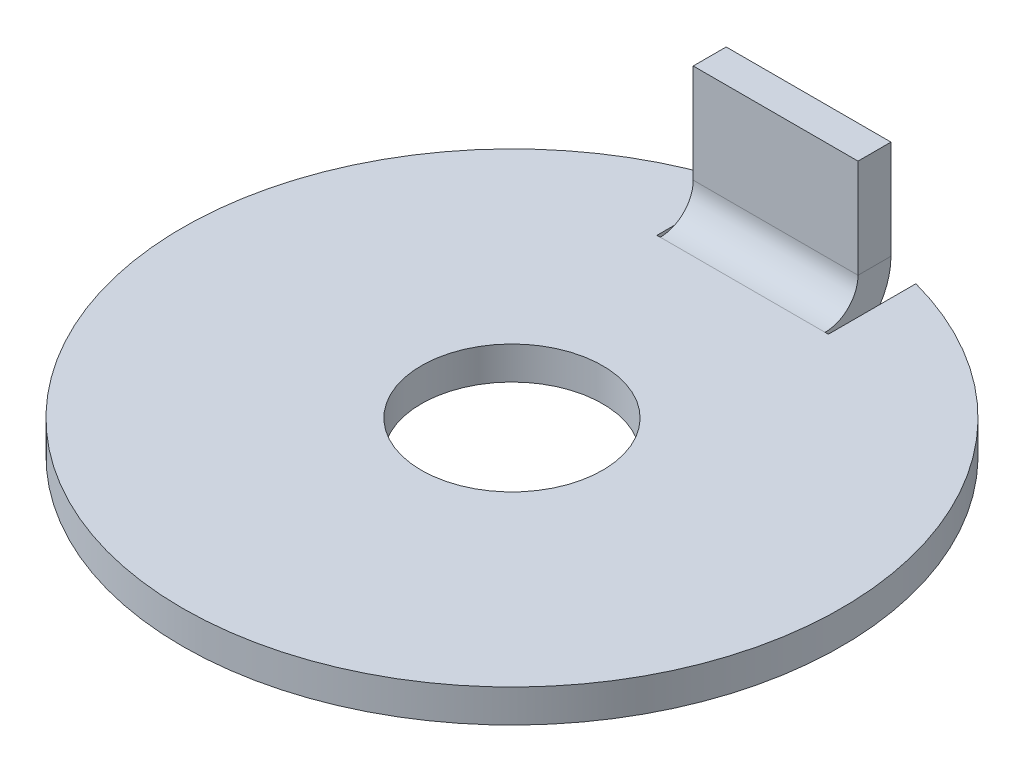
ISO-10303-21;
HEADER;
FILE_DESCRIPTION(('STEP AP214'),'2;1');
FILE_NAME('part.step','',(''),(''),'','','');
FILE_SCHEMA(('AUTOMOTIVE_DESIGN { 1 0 10303 214 1 1 1 1 }'));
ENDSEC;
DATA;
#1=APPLICATION_CONTEXT('core data for automotive mechanical design processes');
#2=APPLICATION_PROTOCOL_DEFINITION('international standard','automotive_design',2000,#1);
#3=PRODUCT_CONTEXT('',#1,'mechanical');
#4=PRODUCT('Part','Part','',(#3));
#5=PRODUCT_RELATED_PRODUCT_CATEGORY('part','',(#4));
#6=PRODUCT_DEFINITION_FORMATION('','',#4);
#7=PRODUCT_DEFINITION_CONTEXT('part definition',#1,'design');
#8=PRODUCT_DEFINITION('design','',#6,#7);
#9=PRODUCT_DEFINITION_SHAPE('','',#8);
#10=(LENGTH_UNIT() NAMED_UNIT(*) SI_UNIT(.MILLI.,.METRE.));
#11=(NAMED_UNIT(*) PLANE_ANGLE_UNIT() SI_UNIT($,.RADIAN.));
#12=(NAMED_UNIT(*) SI_UNIT($,.STERADIAN.) SOLID_ANGLE_UNIT());
#13=UNCERTAINTY_MEASURE_WITH_UNIT(LENGTH_MEASURE(1.E-05),#10,'distance_accuracy_value','');
#14=(GEOMETRIC_REPRESENTATION_CONTEXT(3) GLOBAL_UNCERTAINTY_ASSIGNED_CONTEXT((#13)) GLOBAL_UNIT_ASSIGNED_CONTEXT((#10,
#11,#12)) REPRESENTATION_CONTEXT('',''));
#15=CARTESIAN_POINT('',(0.,0.,0.));
#16=DIRECTION('',(0.,0.,1.));
#17=DIRECTION('',(1.,0.,0.));
#18=AXIS2_PLACEMENT_3D('',#15,#16,#17);
#19=CARTESIAN_POINT('',(2.5,5.,-8.));
#20=DIRECTION('',(1.,0.,0.));
#21=DIRECTION('',(0.,-1.,0.));
#22=AXIS2_PLACEMENT_3D('',#19,#20,#21);
#23=PLANE('',#22);
#24=DIRECTION('',(0.,-1.,0.));
#25=VECTOR('',#24,1.);
#26=CARTESIAN_POINT('',(2.5,5.,-8.));
#27=LINE('',#26,#25);
#28=CARTESIAN_POINT('',(2.5,5.,-8.));
#29=VERTEX_POINT('',#28);
#30=CARTESIAN_POINT('',(2.5,2.,-8.));
#31=VERTEX_POINT('',#30);
#32=EDGE_CURVE('E223',#29,#31,#27,.T.);
#33=ORIENTED_EDGE('',*,*,#32,.T.);
#34=DIRECTION('',(0.,0.,1.));
#35=VECTOR('',#34,1.);
#36=CARTESIAN_POINT('',(2.5,2.,-7.));
#37=LINE('',#36,#35);
#38=CARTESIAN_POINT('',(2.5,2.,-9.));
#39=VERTEX_POINT('',#38);
#40=EDGE_CURVE('E12',#39,#31,#37,.T.);
#41=ORIENTED_EDGE('',*,*,#40,.F.);
#42=DIRECTION('',(0.,-1.,0.));
#43=VECTOR('',#42,1.);
#44=CARTESIAN_POINT('',(2.5,5.,-9.));
#45=LINE('',#44,#43);
#46=CARTESIAN_POINT('',(2.5,5.,-9.));
#47=VERTEX_POINT('',#46);
#48=EDGE_CURVE('E187',#39,#47,#45,.F.);
#49=ORIENTED_EDGE('',*,*,#48,.T.);
#50=DIRECTION('',(0.,0.,1.));
#51=VECTOR('',#50,1.);
#52=CARTESIAN_POINT('',(2.5,5.,-8.));
#53=LINE('',#52,#51);
#54=EDGE_CURVE('E53',#47,#29,#53,.T.);
#55=ORIENTED_EDGE('',*,*,#54,.T.);
#56=EDGE_LOOP('',(#33,#41,#49,#55));
#57=FACE_BOUND('',#56,.T.);
#58=ADVANCED_FACE('F43',(#57),#23,.T.);
#59=CARTESIAN_POINT('',(-2.5,5.,-8.));
#60=DIRECTION('',(0.,1.,0.));
#61=DIRECTION('',(1.,0.,0.));
#62=AXIS2_PLACEMENT_3D('',#59,#60,#61);
#63=PLANE('',#62);
#64=ORIENTED_EDGE('',*,*,#54,.F.);
#65=DIRECTION('',(-1.,0.,0.));
#66=VECTOR('',#65,1.);
#67=CARTESIAN_POINT('',(-2.5,5.,-9.));
#68=LINE('',#67,#66);
#69=CARTESIAN_POINT('',(-2.5,5.,-9.));
#70=VERTEX_POINT('',#69);
#71=EDGE_CURVE('E183',#70,#47,#68,.F.);
#72=ORIENTED_EDGE('',*,*,#71,.F.);
#73=DIRECTION('',(0.,0.,1.));
#74=VECTOR('',#73,1.);
#75=CARTESIAN_POINT('',(-2.5,5.,-8.));
#76=LINE('',#75,#74);
#77=CARTESIAN_POINT('',(-2.5,5.,-8.));
#78=VERTEX_POINT('',#77);
#79=EDGE_CURVE('E201',#70,#78,#76,.T.);
#80=ORIENTED_EDGE('',*,*,#79,.T.);
#81=DIRECTION('',(1.,0.,0.));
#82=VECTOR('',#81,1.);
#83=CARTESIAN_POINT('',(-2.5,5.,-8.));
#84=LINE('',#83,#82);
#85=EDGE_CURVE('E267',#78,#29,#84,.T.);
#86=ORIENTED_EDGE('',*,*,#85,.T.);
#87=EDGE_LOOP('',(#64,#72,#80,#86));
#88=FACE_BOUND('',#87,.T.);
#89=ADVANCED_FACE('F292',(#88),#63,.T.);
#90=CARTESIAN_POINT('',(-2.5,5.,-8.));
#91=DIRECTION('',(1.,0.,0.));
#92=DIRECTION('',(0.,-1.,0.));
#93=AXIS2_PLACEMENT_3D('',#90,#91,#92);
#94=PLANE('',#93);
#95=DIRECTION('',(0.,0.,-1.));
#96=VECTOR('',#95,1.);
#97=CARTESIAN_POINT('',(-2.5,2.,-8.));
#98=LINE('',#97,#96);
#99=CARTESIAN_POINT('',(-2.5,2.,-9.));
#100=VERTEX_POINT('',#99);
#101=CARTESIAN_POINT('',(-2.5,2.,-8.));
#102=VERTEX_POINT('',#101);
#103=EDGE_CURVE('E127',#100,#102,#98,.F.);
#104=ORIENTED_EDGE('',*,*,#103,.T.);
#105=DIRECTION('',(0.,-1.,0.));
#106=VECTOR('',#105,1.);
#107=CARTESIAN_POINT('',(-2.5,5.,-8.));
#108=LINE('',#107,#106);
#109=EDGE_CURVE('E264',#78,#102,#108,.T.);
#110=ORIENTED_EDGE('',*,*,#109,.F.);
#111=ORIENTED_EDGE('',*,*,#79,.F.);
#112=DIRECTION('',(0.,1.,0.));
#113=VECTOR('',#112,1.);
#114=CARTESIAN_POINT('',(-2.5,5.,-9.));
#115=LINE('',#114,#113);
#116=EDGE_CURVE('E195',#70,#100,#115,.F.);
#117=ORIENTED_EDGE('',*,*,#116,.T.);
#118=EDGE_LOOP('',(#104,#110,#111,#117));
#119=FACE_BOUND('',#118,.T.);
#120=ADVANCED_FACE('F284',(#119),#94,.F.);
#121=CARTESIAN_POINT('',(-2.5,2.,-7.));
#122=DIRECTION('',(1.,0.,0.));
#123=DIRECTION('',(0.,0.,-1.));
#124=AXIS2_PLACEMENT_3D('',#121,#122,#123);
#125=PLANE('',#124);
#126=ORIENTED_EDGE('',*,*,#103,.F.);
#127=CARTESIAN_POINT('',(-2.5,2.,-7.));
#128=DIRECTION('',(1.,0.,0.));
#129=DIRECTION('',(0.,0.,-1.));
#130=AXIS2_PLACEMENT_3D('',#127,#128,#129);
#131=CIRCLE('',#130,2.);
#132=CARTESIAN_POINT('',(-2.5,0.,-7.00000000000002));
#133=VERTEX_POINT('',#132);
#134=EDGE_CURVE('E192',#100,#133,#131,.F.);
#135=ORIENTED_EDGE('',*,*,#134,.T.);
#136=DIRECTION('',(0.,1.,0.));
#137=VECTOR('',#136,1.);
#138=CARTESIAN_POINT('',(-2.5,1.,-7.00000000000002));
#139=LINE('',#138,#137);
#140=CARTESIAN_POINT('',(-2.5,1.,-7.));
#141=VERTEX_POINT('',#140);
#142=EDGE_CURVE('E217',#133,#141,#139,.T.);
#143=ORIENTED_EDGE('',*,*,#142,.T.);
#144=CARTESIAN_POINT('',(-2.5,2.,-7.));
#145=DIRECTION('',(1.,0.,0.));
#146=DIRECTION('',(0.,0.,-1.));
#147=AXIS2_PLACEMENT_3D('',#144,#145,#146);
#148=CIRCLE('',#147,1.);
#149=EDGE_CURVE('E211',#102,#141,#148,.F.);
#150=ORIENTED_EDGE('',*,*,#149,.F.);
#151=EDGE_LOOP('',(#126,#135,#143,#150));
#152=FACE_BOUND('',#151,.T.);
#153=ADVANCED_FACE('F285',(#152),#125,.F.);
#154=CARTESIAN_POINT('',(0.,1.,-7.00000000000002));
#155=DIRECTION('',(0.,0.,1.));
#156=DIRECTION('',(1.,0.,0.));
#157=AXIS2_PLACEMENT_3D('',#154,#155,#156);
#158=PLANE('',#157);
#159=ORIENTED_EDGE('',*,*,#142,.F.);
#160=DIRECTION('',(-1.,0.,0.));
#161=VECTOR('',#160,1.);
#162=CARTESIAN_POINT('',(0.,0.,-7.00000000000002));
#163=LINE('',#162,#161);
#164=CARTESIAN_POINT('',(-2.6,0.,-7.00000000000002));
#165=VERTEX_POINT('',#164);
#166=EDGE_CURVE('E47',#165,#133,#163,.F.);
#167=ORIENTED_EDGE('',*,*,#166,.F.);
#168=DIRECTION('',(0.,1.,0.));
#169=VECTOR('',#168,1.);
#170=CARTESIAN_POINT('',(-2.6,1.,-7.00000000000002));
#171=LINE('',#170,#169);
#172=CARTESIAN_POINT('',(-2.6,1.,-7.00000000000002));
#173=VERTEX_POINT('',#172);
#174=EDGE_CURVE('E93',#165,#173,#171,.T.);
#175=ORIENTED_EDGE('',*,*,#174,.T.);
#176=DIRECTION('',(-1.,0.,0.));
#177=VECTOR('',#176,1.);
#178=CARTESIAN_POINT('',(0.,1.,-7.00000000000002));
#179=LINE('',#178,#177);
#180=EDGE_CURVE('E62',#173,#141,#179,.F.);
#181=ORIENTED_EDGE('',*,*,#180,.T.);
#182=EDGE_LOOP('',(#159,#167,#175,#181));
#183=FACE_BOUND('',#182,.T.);
#184=ADVANCED_FACE('F45',(#183),#158,.F.);
#185=CARTESIAN_POINT('',(-2.6,1.,0.));
#186=DIRECTION('',(-1.,0.,0.));
#187=DIRECTION('',(0.,0.,1.));
#188=AXIS2_PLACEMENT_3D('',#185,#186,#187);
#189=PLANE('',#188);
#190=ORIENTED_EDGE('',*,*,#174,.F.);
#191=DIRECTION('',(0.,0.,1.));
#192=VECTOR('',#191,1.);
#193=CARTESIAN_POINT('',(-2.6,0.,0.));
#194=LINE('',#193,#192);
#195=CARTESIAN_POINT('',(-2.6,0.,-8.));
#196=VERTEX_POINT('',#195);
#197=EDGE_CURVE('E188',#196,#165,#194,.T.);
#198=ORIENTED_EDGE('',*,*,#197,.F.);
#199=DIRECTION('',(0.,1.,0.));
#200=VECTOR('',#199,1.);
#201=CARTESIAN_POINT('',(-2.6,1.,-8.));
#202=LINE('',#201,#200);
#203=CARTESIAN_POINT('',(-2.6,1.,-8.));
#204=VERTEX_POINT('',#203);
#205=EDGE_CURVE('E199',#196,#204,#202,.T.);
#206=ORIENTED_EDGE('',*,*,#205,.T.);
#207=DIRECTION('',(0.,0.,1.));
#208=VECTOR('',#207,1.);
#209=CARTESIAN_POINT('',(-2.6,1.,0.));
#210=LINE('',#209,#208);
#211=EDGE_CURVE('E232',#204,#173,#210,.T.);
#212=ORIENTED_EDGE('',*,*,#211,.T.);
#213=EDGE_LOOP('',(#190,#198,#206,#212));
#214=FACE_BOUND('',#213,.T.);
#215=ADVANCED_FACE('F244',(#214),#189,.F.);
#216=ORIENTED_EDGE('',*,*,#205,.F.);
#217=DIRECTION('',(0.,0.,1.));
#218=VECTOR('',#217,1.);
#219=CARTESIAN_POINT('',(-2.6,0.,0.));
#220=LINE('',#219,#218);
#221=CARTESIAN_POINT('',(-2.6,0.,-9.65608616365865));
#222=VERTEX_POINT('',#221);
#223=EDGE_CURVE('E184',#222,#196,#220,.T.);
#224=ORIENTED_EDGE('',*,*,#223,.F.);
#225=DIRECTION('',(0.,1.,0.));
#226=VECTOR('',#225,1.);
#227=CARTESIAN_POINT('',(-2.6,1.,-9.65608616365865));
#228=LINE('',#227,#226);
#229=CARTESIAN_POINT('',(-2.6,1.,-9.65608616365865));
#230=VERTEX_POINT('',#229);
#231=EDGE_CURVE('E103',#222,#230,#228,.T.);
#232=ORIENTED_EDGE('',*,*,#231,.T.);
#233=EDGE_CURVE('E229',#230,#204,#210,.T.);
#234=ORIENTED_EDGE('',*,*,#233,.T.);
#235=EDGE_LOOP('',(#216,#224,#232,#234));
#236=FACE_BOUND('',#235,.T.);
#237=ADVANCED_FACE('F260',(#236),#189,.F.);
#238=CARTESIAN_POINT('',(0.,1.,0.));
#239=DIRECTION('',(0.,1.,0.));
#240=DIRECTION('',(0.,0.,1.));
#241=AXIS2_PLACEMENT_3D('',#238,#239,#240);
#242=CYLINDRICAL_SURFACE('',#241,10.);
#243=ORIENTED_EDGE('',*,*,#231,.F.);
#244=CARTESIAN_POINT('',(0.,0.,0.));
#245=DIRECTION('',(0.,1.,0.));
#246=DIRECTION('',(0.,0.,1.));
#247=AXIS2_PLACEMENT_3D('',#244,#245,#246);
#248=CIRCLE('',#247,10.);
#249=CARTESIAN_POINT('',(2.6,0.,-9.65608616365865));
#250=VERTEX_POINT('',#249);
#251=EDGE_CURVE('E180',#222,#250,#248,.T.);
#252=ORIENTED_EDGE('',*,*,#251,.T.);
#253=DIRECTION('',(0.,1.,0.));
#254=VECTOR('',#253,1.);
#255=CARTESIAN_POINT('',(2.6,1.,-9.65608616365865));
#256=LINE('',#255,#254);
#257=CARTESIAN_POINT('',(2.6,1.,-9.65608616365865));
#258=VERTEX_POINT('',#257);
#259=EDGE_CURVE('E158',#250,#258,#256,.T.);
#260=ORIENTED_EDGE('',*,*,#259,.T.);
#261=CARTESIAN_POINT('',(0.,1.,0.));
#262=DIRECTION('',(0.,1.,0.));
#263=DIRECTION('',(0.,0.,1.));
#264=AXIS2_PLACEMENT_3D('',#261,#262,#263);
#265=CIRCLE('',#264,10.);
#266=EDGE_CURVE('E262',#230,#258,#265,.T.);
#267=ORIENTED_EDGE('',*,*,#266,.F.);
#268=EDGE_LOOP('',(#243,#252,#260,#267));
#269=FACE_BOUND('',#268,.T.);
#270=ADVANCED_FACE('F263',(#269),#242,.T.);
#271=CARTESIAN_POINT('',(2.6,1.,0.));
#272=DIRECTION('',(1.,0.,0.));
#273=DIRECTION('',(0.,0.,-1.));
#274=AXIS2_PLACEMENT_3D('',#271,#272,#273);
#275=PLANE('',#274);
#276=ORIENTED_EDGE('',*,*,#259,.F.);
#277=DIRECTION('',(0.,0.,1.));
#278=VECTOR('',#277,1.);
#279=CARTESIAN_POINT('',(2.6,0.,0.));
#280=LINE('',#279,#278);
#281=CARTESIAN_POINT('',(2.6,0.,-8.));
#282=VERTEX_POINT('',#281);
#283=EDGE_CURVE('E163',#282,#250,#280,.F.);
#284=ORIENTED_EDGE('',*,*,#283,.F.);
#285=DIRECTION('',(0.,1.,0.));
#286=VECTOR('',#285,1.);
#287=CARTESIAN_POINT('',(2.6,1.,-8.));
#288=LINE('',#287,#286);
#289=CARTESIAN_POINT('',(2.6,1.,-8.));
#290=VERTEX_POINT('',#289);
#291=EDGE_CURVE('E148',#282,#290,#288,.T.);
#292=ORIENTED_EDGE('',*,*,#291,.T.);
#293=DIRECTION('',(0.,0.,-1.));
#294=VECTOR('',#293,1.);
#295=CARTESIAN_POINT('',(2.6,1.,0.));
#296=LINE('',#295,#294);
#297=EDGE_CURVE('E228',#290,#258,#296,.T.);
#298=ORIENTED_EDGE('',*,*,#297,.T.);
#299=EDGE_LOOP('',(#276,#284,#292,#298));
#300=FACE_BOUND('',#299,.T.);
#301=ADVANCED_FACE('F164',(#300),#275,.F.);
#302=ORIENTED_EDGE('',*,*,#291,.F.);
#303=DIRECTION('',(0.,0.,1.));
#304=VECTOR('',#303,1.);
#305=CARTESIAN_POINT('',(2.6,0.,0.));
#306=LINE('',#305,#304);
#307=CARTESIAN_POINT('',(2.6,0.,-7.00000000000002));
#308=VERTEX_POINT('',#307);
#309=EDGE_CURVE('E152',#308,#282,#306,.F.);
#310=ORIENTED_EDGE('',*,*,#309,.F.);
#311=DIRECTION('',(0.,1.,0.));
#312=VECTOR('',#311,1.);
#313=CARTESIAN_POINT('',(2.6,1.,-7.00000000000002));
#314=LINE('',#313,#312);
#315=CARTESIAN_POINT('',(2.6,1.,-7.00000000000002));
#316=VERTEX_POINT('',#315);
#317=EDGE_CURVE('E159',#308,#316,#314,.T.);
#318=ORIENTED_EDGE('',*,*,#317,.T.);
#319=EDGE_CURVE('E154',#316,#290,#296,.T.);
#320=ORIENTED_EDGE('',*,*,#319,.T.);
#321=EDGE_LOOP('',(#302,#310,#318,#320));
#322=FACE_BOUND('',#321,.T.);
#323=ADVANCED_FACE('F150',(#322),#275,.F.);
#324=CARTESIAN_POINT('',(0.,1.,-7.00000000000002));
#325=DIRECTION('',(0.,0.,1.));
#326=DIRECTION('',(1.,0.,0.));
#327=AXIS2_PLACEMENT_3D('',#324,#325,#326);
#328=PLANE('',#327);
#329=ORIENTED_EDGE('',*,*,#317,.F.);
#330=DIRECTION('',(-1.,0.,0.));
#331=VECTOR('',#330,1.);
#332=CARTESIAN_POINT('',(0.,0.,-7.00000000000002));
#333=LINE('',#332,#331);
#334=CARTESIAN_POINT('',(2.5,0.,-7.00000000000002));
#335=VERTEX_POINT('',#334);
#336=EDGE_CURVE('E166',#335,#308,#333,.F.);
#337=ORIENTED_EDGE('',*,*,#336,.F.);
#338=DIRECTION('',(0.,1.,0.));
#339=VECTOR('',#338,1.);
#340=CARTESIAN_POINT('',(2.5,1.,-7.));
#341=LINE('',#340,#339);
#342=CARTESIAN_POINT('',(2.5,1.,-7.00000000000002));
#343=VERTEX_POINT('',#342);
#344=EDGE_CURVE('E204',#335,#343,#341,.T.);
#345=ORIENTED_EDGE('',*,*,#344,.T.);
#346=DIRECTION('',(-1.,0.,0.));
#347=VECTOR('',#346,1.);
#348=CARTESIAN_POINT('',(0.,1.,-7.00000000000002));
#349=LINE('',#348,#347);
#350=EDGE_CURVE('E225',#343,#316,#349,.F.);
#351=ORIENTED_EDGE('',*,*,#350,.T.);
#352=EDGE_LOOP('',(#329,#337,#345,#351));
#353=FACE_BOUND('',#352,.T.);
#354=ADVANCED_FACE('F306',(#353),#328,.F.);
#355=CARTESIAN_POINT('',(0.,1.,0.));
#356=DIRECTION('',(0.,1.,0.));
#357=DIRECTION('',(0.,0.,1.));
#358=AXIS2_PLACEMENT_3D('',#355,#356,#357);
#359=CYLINDRICAL_SURFACE('',#358,2.75);
#360=CARTESIAN_POINT('',(0.,1.,0.));
#361=DIRECTION('',(0.,1.,0.));
#362=DIRECTION('',(0.,0.,1.));
#363=AXIS2_PLACEMENT_3D('',#360,#361,#362);
#364=CIRCLE('',#363,2.75);
#365=CARTESIAN_POINT('',(0.,1.,2.75));
#366=VERTEX_POINT('',#365);
#367=EDGE_CURVE('E233',#366,#366,#364,.T.);
#368=ORIENTED_EDGE('',*,*,#367,.T.);
#369=EDGE_LOOP('',(#368));
#370=FACE_BOUND('',#369,.T.);
#371=CARTESIAN_POINT('',(0.,0.,0.));
#372=DIRECTION('',(0.,1.,0.));
#373=DIRECTION('',(0.,0.,1.));
#374=AXIS2_PLACEMENT_3D('',#371,#372,#373);
#375=CIRCLE('',#374,2.75);
#376=CARTESIAN_POINT('',(0.,0.,2.75));
#377=VERTEX_POINT('',#376);
#378=EDGE_CURVE('E182',#377,#377,#375,.T.);
#379=ORIENTED_EDGE('',*,*,#378,.F.);
#380=EDGE_LOOP('',(#379));
#381=FACE_BOUND('',#380,.T.);
#382=ADVANCED_FACE('F304',(#370,#381),#359,.F.);
#383=CARTESIAN_POINT('',(2.5,2.,-7.));
#384=DIRECTION('',(-1.,0.,0.));
#385=DIRECTION('',(0.,0.,1.));
#386=AXIS2_PLACEMENT_3D('',#383,#384,#385);
#387=PLANE('',#386);
#388=CARTESIAN_POINT('',(2.5,2.,-7.));
#389=DIRECTION('',(-1.,0.,0.));
#390=DIRECTION('',(0.,0.,1.));
#391=AXIS2_PLACEMENT_3D('',#388,#389,#390);
#392=CIRCLE('',#391,2.);
#393=EDGE_CURVE('E213',#335,#39,#392,.F.);
#394=ORIENTED_EDGE('',*,*,#393,.T.);
#395=ORIENTED_EDGE('',*,*,#40,.T.);
#396=CARTESIAN_POINT('',(2.5,2.,-7.));
#397=DIRECTION('',(-1.,0.,0.));
#398=DIRECTION('',(0.,0.,1.));
#399=AXIS2_PLACEMENT_3D('',#396,#397,#398);
#400=CIRCLE('',#399,1.);
#401=EDGE_CURVE('E208',#343,#31,#400,.F.);
#402=ORIENTED_EDGE('',*,*,#401,.F.);
#403=ORIENTED_EDGE('',*,*,#344,.F.);
#404=EDGE_LOOP('',(#394,#395,#402,#403));
#405=FACE_BOUND('',#404,.T.);
#406=ADVANCED_FACE('F276',(#405),#387,.F.);
#407=CARTESIAN_POINT('',(0.,1.,0.));
#408=DIRECTION('',(0.,1.,0.));
#409=DIRECTION('',(0.,0.,1.));
#410=AXIS2_PLACEMENT_3D('',#407,#408,#409);
#411=PLANE('',#410);
#412=ORIENTED_EDGE('',*,*,#350,.F.);
#413=DIRECTION('',(1.,0.,0.));
#414=VECTOR('',#413,1.);
#415=CARTESIAN_POINT('',(0.,1.,-7.));
#416=LINE('',#415,#414);
#417=EDGE_CURVE('E206',#343,#141,#416,.F.);
#418=ORIENTED_EDGE('',*,*,#417,.T.);
#419=ORIENTED_EDGE('',*,*,#180,.F.);
#420=ORIENTED_EDGE('',*,*,#211,.F.);
#421=ORIENTED_EDGE('',*,*,#233,.F.);
#422=ORIENTED_EDGE('',*,*,#266,.T.);
#423=ORIENTED_EDGE('',*,*,#297,.F.);
#424=ORIENTED_EDGE('',*,*,#319,.F.);
#425=EDGE_LOOP('',(#412,#418,#419,#420,#421,#422,#423,#424));
#426=FACE_BOUND('',#425,.T.);
#427=ORIENTED_EDGE('',*,*,#367,.F.);
#428=EDGE_LOOP('',(#427));
#429=FACE_BOUND('',#428,.T.);
#430=ADVANCED_FACE('F240',(#426,#429),#411,.T.);
#431=CARTESIAN_POINT('',(-2.5,5.,-8.));
#432=DIRECTION('',(0.,0.,-1.));
#433=DIRECTION('',(-1.,0.,0.));
#434=AXIS2_PLACEMENT_3D('',#431,#432,#433);
#435=PLANE('',#434);
#436=ORIENTED_EDGE('',*,*,#109,.T.);
#437=DIRECTION('',(1.,0.,0.));
#438=VECTOR('',#437,1.);
#439=CARTESIAN_POINT('',(-2.5,2.,-8.));
#440=LINE('',#439,#438);
#441=EDGE_CURVE('E250',#102,#31,#440,.T.);
#442=ORIENTED_EDGE('',*,*,#441,.T.);
#443=ORIENTED_EDGE('',*,*,#32,.F.);
#444=ORIENTED_EDGE('',*,*,#85,.F.);
#445=EDGE_LOOP('',(#436,#442,#443,#444));
#446=FACE_BOUND('',#445,.T.);
#447=ADVANCED_FACE('F280',(#446),#435,.F.);
#448=CARTESIAN_POINT('',(-2.5,2.,-7.));
#449=DIRECTION('',(1.,0.,0.));
#450=DIRECTION('',(0.,0.,-1.));
#451=AXIS2_PLACEMENT_3D('',#448,#449,#450);
#452=CYLINDRICAL_SURFACE('',#451,1.);
#453=ORIENTED_EDGE('',*,*,#149,.T.);
#454=ORIENTED_EDGE('',*,*,#417,.F.);
#455=ORIENTED_EDGE('',*,*,#401,.T.);
#456=ORIENTED_EDGE('',*,*,#441,.F.);
#457=EDGE_LOOP('',(#453,#454,#455,#456));
#458=FACE_BOUND('',#457,.T.);
#459=ADVANCED_FACE('F279',(#458),#452,.F.);
#460=CARTESIAN_POINT('',(0.,0.,0.));
#461=DIRECTION('',(0.,1.,0.));
#462=DIRECTION('',(0.,0.,1.));
#463=AXIS2_PLACEMENT_3D('',#460,#461,#462);
#464=PLANE('',#463);
#465=DIRECTION('',(1.,0.,0.));
#466=VECTOR('',#465,1.);
#467=CARTESIAN_POINT('',(0.,0.,-7.));
#468=LINE('',#467,#466);
#469=EDGE_CURVE('E176',#335,#133,#468,.F.);
#470=ORIENTED_EDGE('',*,*,#469,.F.);
#471=ORIENTED_EDGE('',*,*,#336,.T.);
#472=ORIENTED_EDGE('',*,*,#309,.T.);
#473=ORIENTED_EDGE('',*,*,#283,.T.);
#474=ORIENTED_EDGE('',*,*,#251,.F.);
#475=ORIENTED_EDGE('',*,*,#223,.T.);
#476=ORIENTED_EDGE('',*,*,#197,.T.);
#477=ORIENTED_EDGE('',*,*,#166,.T.);
#478=EDGE_LOOP('',(#470,#471,#472,#473,#474,#475,#476,#477));
#479=FACE_BOUND('',#478,.T.);
#480=ORIENTED_EDGE('',*,*,#378,.T.);
#481=EDGE_LOOP('',(#480));
#482=FACE_BOUND('',#481,.T.);
#483=ADVANCED_FACE('F170',(#479,#482),#464,.F.);
#484=CARTESIAN_POINT('',(-2.5,5.,-9.));
#485=DIRECTION('',(0.,0.,-1.));
#486=DIRECTION('',(-1.,0.,0.));
#487=AXIS2_PLACEMENT_3D('',#484,#485,#486);
#488=PLANE('',#487);
#489=ORIENTED_EDGE('',*,*,#116,.F.);
#490=ORIENTED_EDGE('',*,*,#71,.T.);
#491=ORIENTED_EDGE('',*,*,#48,.F.);
#492=DIRECTION('',(-1.,0.,0.));
#493=VECTOR('',#492,1.);
#494=CARTESIAN_POINT('',(-2.5,2.,-9.));
#495=LINE('',#494,#493);
#496=EDGE_CURVE('E173',#100,#39,#495,.F.);
#497=ORIENTED_EDGE('',*,*,#496,.F.);
#498=EDGE_LOOP('',(#489,#490,#491,#497));
#499=FACE_BOUND('',#498,.T.);
#500=ADVANCED_FACE('F322',(#499),#488,.T.);
#501=CARTESIAN_POINT('',(-2.5,2.,-7.));
#502=DIRECTION('',(1.,0.,0.));
#503=DIRECTION('',(0.,0.,-1.));
#504=AXIS2_PLACEMENT_3D('',#501,#502,#503);
#505=CYLINDRICAL_SURFACE('',#504,2.);
#506=ORIENTED_EDGE('',*,*,#134,.F.);
#507=ORIENTED_EDGE('',*,*,#496,.T.);
#508=ORIENTED_EDGE('',*,*,#393,.F.);
#509=ORIENTED_EDGE('',*,*,#469,.T.);
#510=EDGE_LOOP('',(#506,#507,#508,#509));
#511=FACE_BOUND('',#510,.T.);
#512=ADVANCED_FACE('F256',(#511),#505,.T.);
#513=CLOSED_SHELL('',(#58,#89,#120,#153,#184,#215,#237,#270,#301,#323,#354,#382,#406,#430,#447,
#459,#483,#500,#512));
#514=MANIFOLD_SOLID_BREP('B2',#513);
#515=ADVANCED_BREP_SHAPE_REPRESENTATION('',(#18,#514),#14);
#516=SHAPE_DEFINITION_REPRESENTATION(#9,#515);
ENDSEC;
END-ISO-10303-21;
